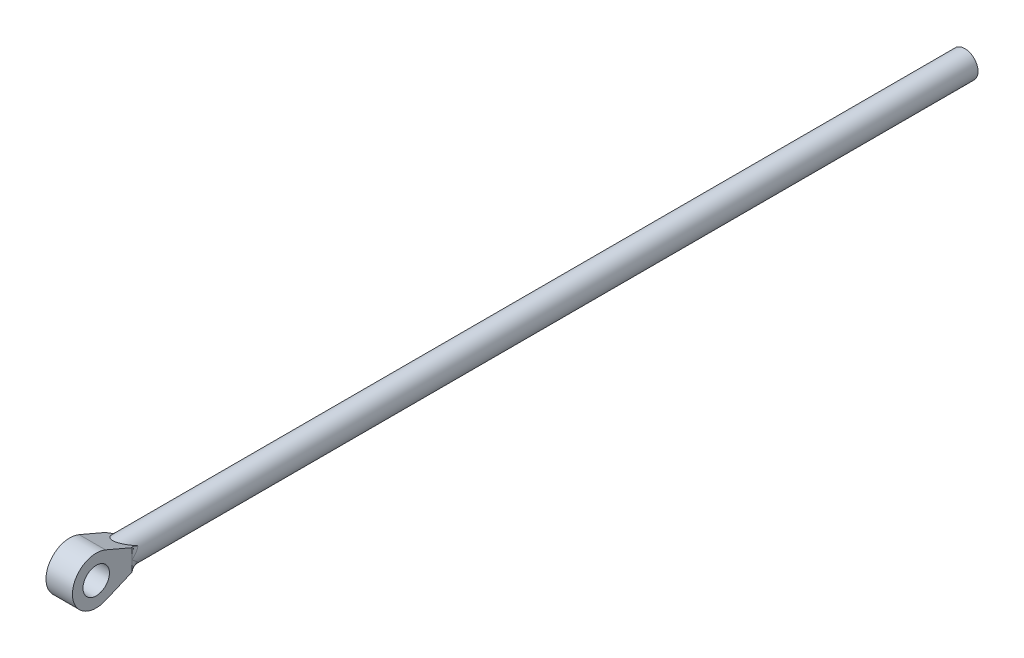
ISO-10303-21;
HEADER;
FILE_DESCRIPTION(('STEP AP214'),'2;1');
FILE_NAME('part.step','',(''),(''),'','','');
FILE_SCHEMA(('AUTOMOTIVE_DESIGN { 1 0 10303 214 1 1 1 1 }'));
ENDSEC;
DATA;
#1=APPLICATION_CONTEXT('core data for automotive mechanical design processes');
#2=APPLICATION_PROTOCOL_DEFINITION('international standard','automotive_design',2000,#1);
#3=PRODUCT_CONTEXT('',#1,'mechanical');
#4=PRODUCT('Part','Part','',(#3));
#5=PRODUCT_RELATED_PRODUCT_CATEGORY('part','',(#4));
#6=PRODUCT_DEFINITION_FORMATION('','',#4);
#7=PRODUCT_DEFINITION_CONTEXT('part definition',#1,'design');
#8=PRODUCT_DEFINITION('design','',#6,#7);
#9=PRODUCT_DEFINITION_SHAPE('','',#8);
#10=(LENGTH_UNIT() NAMED_UNIT(*) SI_UNIT(.MILLI.,.METRE.));
#11=(NAMED_UNIT(*) PLANE_ANGLE_UNIT() SI_UNIT($,.RADIAN.));
#12=(NAMED_UNIT(*) SI_UNIT($,.STERADIAN.) SOLID_ANGLE_UNIT());
#13=UNCERTAINTY_MEASURE_WITH_UNIT(LENGTH_MEASURE(1.E-05),#10,'distance_accuracy_value','');
#14=(GEOMETRIC_REPRESENTATION_CONTEXT(3) GLOBAL_UNCERTAINTY_ASSIGNED_CONTEXT((#13)) GLOBAL_UNIT_ASSIGNED_CONTEXT((#10,
#11,#12)) REPRESENTATION_CONTEXT('',''));
#15=CARTESIAN_POINT('',(0.,0.,0.));
#16=DIRECTION('',(0.,0.,1.));
#17=DIRECTION('',(1.,0.,0.));
#18=AXIS2_PLACEMENT_3D('',#15,#16,#17);
#19=CARTESIAN_POINT('',(3.175,-2.54,-8.59666640241181));
#20=DIRECTION('',(0.,0.919488252420341,0.393117480736976));
#21=DIRECTION('',(0.,-0.393117480736976,0.919488252420342));
#22=AXIS2_PLACEMENT_3D('',#19,#20,#21);
#23=PLANE('',#22);
#24=CARTESIAN_POINT('',(0.,0.,-14.5376389502871));
#25=DIRECTION('',(0.,0.919488252420341,0.393117480736976));
#26=DIRECTION('',(0.,0.393117480736976,-0.919488252420342));
#27=AXIS2_PLACEMENT_3D('',#24,#25,#26);
#28=ELLIPSE('',#27,8.07646608349199,3.175);
#29=CARTESIAN_POINT('',(2.67478021597462,-1.71060685028173,-10.5365884236224));
#30=VERTEX_POINT('',#29);
#31=CARTESIAN_POINT('',(-2.67478021597462,-1.71060685028173,-10.5365884236224));
#32=VERTEX_POINT('',#31);
#33=EDGE_CURVE('E60',#30,#32,#28,.F.);
#34=ORIENTED_EDGE('',*,*,#33,.F.);
#35=CARTESIAN_POINT('',(3.175,-3.99391372425977,-8.59666640241181));
#36=CARTESIAN_POINT('',(1.91635195902802,-2.58180728087389,-9.08135002022511));
#37=CARTESIAN_POINT('',(2.2709843247912,-2.2188409579221,-10.9669928924115));
#38=CARTESIAN_POINT('',(3.175,-3.89822005365016,-8.59666640241181));
#39=CARTESIAN_POINT('',(1.95759279660153,-2.55659693582673,-9.12196996566286));
#40=CARTESIAN_POINT('',(2.32292862845712,-2.16567780741768,-10.930950971675));
#41=CARTESIAN_POINT('',(3.175,-3.80022115930709,-8.59666640241181));
#42=CARTESIAN_POINT('',(2.00429072887889,-2.5244105662156,-9.15651333968208));
#43=CARTESIAN_POINT('',(2.37247234749937,-2.1112339772152,-10.8902967558312));
#44=CARTESIAN_POINT('',(3.175,-3.60055329402831,-8.59666640241181));
#45=CARTESIAN_POINT('',(2.10288828272783,-2.44821078011972,-9.2124927740083));
#46=CARTESIAN_POINT('',(2.46671432485945,-2.0003073854646,-10.8012878913684));
#47=CARTESIAN_POINT('',(3.175,-3.49889095821979,-8.59666640241181));
#48=CARTESIAN_POINT('',(2.15470476601244,-2.40445660023307,-9.23428275530779));
#49=CARTESIAN_POINT('',(2.51142080890993,-1.9438283100981,-10.7529466716865));
#50=CARTESIAN_POINT('',(3.175,-3.29305802574432,-8.59666640241181));
#51=CARTESIAN_POINT('',(2.25918856417076,-2.30694472080806,-9.26551549867763));
#52=CARTESIAN_POINT('',(2.59589449034021,-1.82947668099294,-10.6502315770057));
#53=CARTESIAN_POINT('',(3.175,-3.18890394684718,-8.59666640241181));
#54=CARTESIAN_POINT('',(2.31189565918958,-2.25339342902035,-9.27530338538349));
#55=CARTESIAN_POINT('',(2.63568706696168,-1.77161330379369,-10.5958917037651));
#56=CARTESIAN_POINT('',(3.175,-2.97809879860918,-8.59666640241181));
#57=CARTESIAN_POINT('',(2.415737066997,-2.13788631172421,-9.28426183538017));
#58=CARTESIAN_POINT('',(2.71073717770064,-1.65449933253319,-10.4820493293361));
#59=CARTESIAN_POINT('',(3.175,-2.87144627945739,-8.59666640241181));
#60=CARTESIAN_POINT('',(2.46698878164801,-2.07598791576069,-9.2836366142665));
#61=CARTESIAN_POINT('',(2.74599199749794,-1.59524793302146,-10.4225437735276));
#62=CARTESIAN_POINT('',(3.175,-2.45809990923821,-8.59666640241181));
#63=CARTESIAN_POINT('',(2.65372910886165,-1.82885051358634,-9.26383542983603));
#64=CARTESIAN_POINT('',(2.87287229613947,-1.36561106071748,-10.1860471642477));
#65=CARTESIAN_POINT('',(3.175,-2.14412743110158,-8.59666640241181));
#66=CARTESIAN_POINT('',(2.78145144382993,-1.61490717806444,-9.2138654185811));
#67=CARTESIAN_POINT('',(2.9489698685196,-1.19118190617343,-9.99419431779141));
#68=CARTESIAN_POINT('',(3.175,-1.50745726875889,-8.59666640241181));
#69=CARTESIAN_POINT('',(2.98354146972774,-1.159687990128,-9.07123962113244));
#70=CARTESIAN_POINT('',(3.06825926307117,-0.837476260415707,-9.59223853373834));
#71=CARTESIAN_POINT('',(3.175,-1.18474093473537,-8.59666640241181));
#72=CARTESIAN_POINT('',(3.06100044766743,-0.91555636745583,-8.97863920011173));
#73=CARTESIAN_POINT('',(3.11137388897597,-0.658189408192424,-9.38209405614999));
#74=CARTESIAN_POINT('',(3.175,-0.71952408724998,-8.59666640241181));
#75=CARTESIAN_POINT('',(3.13141138232832,-0.558155895048426,-8.83342360639511));
#76=CARTESIAN_POINT('',(3.15072965960417,-0.39973560402509,-9.0753075460424));
#77=CARTESIAN_POINT('',(3.175,-0.578219683916854,-8.59666640241181));
#78=CARTESIAN_POINT('',(3.14749268943646,-0.448982202265444,-8.78784669658839));
#79=CARTESIAN_POINT('',(3.15969106547785,-0.321233157722816,-8.98161928182636));
#80=CARTESIAN_POINT('',(3.175,-0.295456882461807,-8.59666640241181));
#81=CARTESIAN_POINT('',(3.16908360806762,-0.229956089790282,-8.69520065085295));
#82=CARTESIAN_POINT('',(3.17173138716422,-0.164142712471253,-8.79363104917733));
#83=CARTESIAN_POINT('',(3.175,-0.153999062517953,-8.59666640241181));
#84=CARTESIAN_POINT('',(3.17467408200621,-0.119781543608713,-8.64800082128869));
#85=CARTESIAN_POINT('',(3.17481939932961,-0.0855550347319821,-8.69933225397546));
#86=CARTESIAN_POINT('',(3.175,-0.00838676855715619,-8.59666640241181));
#87=CARTESIAN_POINT('',(3.17499540716319,-0.00652304627986016,-8.59946199393057));
#88=CARTESIAN_POINT('',(3.1749974348638,-0.00465931586509317,-8.60225758054907));
#89=CARTESIAN_POINT('',(3.175,-0.0041933642145215,-8.59666640241181));
#90=CARTESIAN_POINT('',(3.17500002361483,-0.00326150528047754,-8.59806419065323));
#91=CARTESIAN_POINT('',(3.17499999886311,-0.00232964678585178,-8.59946197762139));
#92=CARTESIAN_POINT('',(3.175,0.,-8.59666640241181));
#93=CARTESIAN_POINT('',(3.175,0.,-8.59666640241181));
#94=CARTESIAN_POINT('',(3.175,0.,-8.59666640241181));
#95=(BOUNDED_SURFACE() B_SPLINE_SURFACE(3,2,((#35,#36,#37),(#38,#39,#40),(#41,#42,#43),(#44,#45,
#46),(#47,#48,#49),(#50,#51,#52),(#53,#54,#55),(#56,#57,#58),(#59,#60,#61),(#62,#63,#64),(#65,
#66,#67),(#68,#69,#70),(#71,#72,#73),(#74,#75,#76),(#77,#78,#79),(#80,#81,#82),(#83,#84,#85),
(#86,#87,#88),(#89,#90,#91),(#92,#93,#94)),.UNSPECIFIED.,.F.,.F.,
.F.) B_SPLINE_SURFACE_WITH_KNOTS((4,2,2,2,2,2,2,2,2,4),(3,3),(0.,0.415332256370436,
0.829946755224234,1.24232133703608,1.654941451117,2.82617024859253,4.00013197924569,
4.51081216118512,5.02070078684461,5.03582031698667),(0.,1.),
.UNSPECIFIED.) GEOMETRIC_REPRESENTATION_ITEM() RATIONAL_B_SPLINE_SURFACE(((1.,0.792792193937669,
1.),(1.,0.802959628543372,1.),(1.,0.813010799359625,1.),(1.,0.832659898007525,1.),(1.,
0.842258579094277,1.),(1.,0.860768395540024,1.),(1.,0.869682965154839,1.),(1.,0.886767288107134,
1.),(1.,0.894936594812638,1.),(1.,0.924685397988841,1.),(1.,0.943306333627146,1.),(1.,
0.972868676598953,1.),(1.,0.983792063214889,1.),(1.,0.993800512945255,1.),(1.,0.996087213683453,
1.),(1.,0.999162677962766,1.),(1.,0.99995375781857,1.),(1.,0.999999344324297,1.),(1.,
1.00000000050463,1.),(1.,1.,1.))) REPRESENTATION_ITEM('') SURFACE());
#96=CARTESIAN_POINT('',(2.67478021597462,-1.71060685028173,-10.5365884236224));
#97=CARTESIAN_POINT('',(2.65896090264,-1.73531539556926,-10.4787959869083));
#98=CARTESIAN_POINT('',(2.64593621557644,-1.76029878647662,-10.420360695753));
#99=CARTESIAN_POINT('',(2.62553049389253,-1.81061036745387,-10.3026836400732));
#100=CARTESIAN_POINT('',(2.61814746922412,-1.83593843273112,-10.2434421674344));
#101=CARTESIAN_POINT('',(2.60910197685768,-1.88656334811981,-10.1250322333547));
#102=CARTESIAN_POINT('',(2.60739739857218,-1.91185903103886,-10.0658665019366));
#103=CARTESIAN_POINT('',(2.6095066684818,-1.96240864273729,-9.94763270059563));
#104=CARTESIAN_POINT('',(2.61332064463398,-1.9876625705349,-9.88856463296902));
#105=CARTESIAN_POINT('',(2.63281257740658,-2.06303534503004,-9.71227030850734));
#106=CARTESIAN_POINT('',(2.65652439970803,-2.1128621816823,-9.59572705311423));
#107=CARTESIAN_POINT('',(2.72339626694493,-2.2105517330952,-9.36723455580789));
#108=CARTESIAN_POINT('',(2.76661269268708,-2.25840831180812,-9.25529966589898));
#109=CARTESIAN_POINT('',(2.86511682529915,-2.34680416276593,-9.04854481397524));
#110=CARTESIAN_POINT('',(2.91888766253763,-2.38760837538996,-8.95310516553549));
#111=CARTESIAN_POINT('',(3.03839194604737,-2.466147032211,-8.76940595131474));
#112=CARTESIAN_POINT('',(3.10406499104079,-2.50389564396833,-8.68111324809796));
#113=CARTESIAN_POINT('',(3.175,-2.54,-8.59666640241181));
#114=B_SPLINE_CURVE_WITH_KNOTS('',3,(#96,#97,#98,#99,#100,#101,#102,#103,#104,#105,#106,#107,
#108,#109,#110,#111,#112,#113),.UNSPECIFIED.,.F.,.F.,(4,2,2,2,2,2,2,2,4),(0.,0.194369428069471,
0.388670262298564,0.581526941681752,0.774388092846381,1.15937812629279,1.54548822699539,
1.89529807344013,2.24338003319203),.UNSPECIFIED.);
#115=CARTESIAN_POINT('',(3.175,-2.54,-8.59666640241181));
#116=VERTEX_POINT('',#115);
#117=EDGE_CURVE('E103',#30,#116,#114,.T.);
#118=ORIENTED_EDGE('',*,*,#117,.T.);
#119=DIRECTION('',(0.,0.393117480736976,-0.919488252420341));
#120=VECTOR('',#119,1.);
#121=CARTESIAN_POINT('',(3.175,-2.54,-8.59666640241181));
#122=LINE('',#121,#120);
#123=CARTESIAN_POINT('',(3.175,-5.25487536258225,-2.24666640241182));
#124=VERTEX_POINT('',#123);
#125=EDGE_CURVE('E97',#124,#116,#122,.T.);
#126=ORIENTED_EDGE('',*,*,#125,.F.);
#127=DIRECTION('',(-1.,0.,0.));
#128=VECTOR('',#127,1.);
#129=CARTESIAN_POINT('',(3.175,-5.25487536258225,-2.24666640241182));
#130=LINE('',#129,#128);
#131=CARTESIAN_POINT('',(-3.175,-5.25487536258225,-2.24666640241182));
#132=VERTEX_POINT('',#131);
#133=EDGE_CURVE('E100',#124,#132,#130,.T.);
#134=ORIENTED_EDGE('',*,*,#133,.T.);
#135=DIRECTION('',(0.,0.393117480736976,-0.919488252420341));
#136=VECTOR('',#135,1.);
#137=CARTESIAN_POINT('',(-3.175,-2.54,-8.59666640241181));
#138=LINE('',#137,#136);
#139=CARTESIAN_POINT('',(-3.175,-2.54,-8.59666640241181));
#140=VERTEX_POINT('',#139);
#141=EDGE_CURVE('E264',#132,#140,#138,.T.);
#142=ORIENTED_EDGE('',*,*,#141,.T.);
#143=CARTESIAN_POINT('',(-2.27098432479365,-2.21884095791959,-10.9669928924098));
#144=CARTESIAN_POINT('',(-1.91635195902998,-2.58180728087268,-9.08135002022703));
#145=CARTESIAN_POINT('',(-3.175,-3.99391372425527,-8.59666640241181));
#146=CARTESIAN_POINT('',(-2.32292862845958,-2.16567780741504,-10.9309509716731));
#147=CARTESIAN_POINT('',(-1.95759279660373,-2.55659693582527,-9.12196996566466));
#148=CARTESIAN_POINT('',(-3.175,-3.89822005364541,-8.59666640241181));
#149=CARTESIAN_POINT('',(-2.37247234750184,-2.11123397721242,-10.8902967558291));
#150=CARTESIAN_POINT('',(-2.0042907288813,-2.52441056621388,-9.15651333968373));
#151=CARTESIAN_POINT('',(-3.175,-3.8002211593021,-8.59666640241181));
#152=CARTESIAN_POINT('',(-2.46671432486192,-2.00030738546156,-10.8012878913658));
#153=CARTESIAN_POINT('',(-2.10288828273059,-2.44821078011745,-9.2124927740096));
#154=CARTESIAN_POINT('',(-3.175,-3.60055329402282,-8.59666640241181));
#155=CARTESIAN_POINT('',(-2.5114208089124,-1.94382831009492,-10.7529466716838));
#156=CARTESIAN_POINT('',(-2.15470476601536,-2.40445660023053,-9.2342827553089));
#157=CARTESIAN_POINT('',(-3.175,-3.49889095821406,-8.59666640241181));
#158=CARTESIAN_POINT('',(-2.59589449034265,-1.82947668098949,-10.6502315770025));
#159=CARTESIAN_POINT('',(-2.25918856417391,-2.30694472080496,-9.26551549867833));
#160=CARTESIAN_POINT('',(-3.175,-3.29305802573812,-8.59666640241181));
#161=CARTESIAN_POINT('',(-2.63568706696408,-1.77161330379011,-10.5958917037617));
#162=CARTESIAN_POINT('',(-2.31189565919281,-2.25339342901697,-9.27530338538399));
#163=CARTESIAN_POINT('',(-3.175,-3.18890394684074,-8.59666640241181));
#164=CARTESIAN_POINT('',(-2.71073717770298,-1.65449933252936,-10.4820493293323));
#165=CARTESIAN_POINT('',(-2.41573706700034,-2.13788631172029,-9.28426183538024));
#166=CARTESIAN_POINT('',(-3.175,-2.97809879860228,-8.59666640241181));
#167=CARTESIAN_POINT('',(-2.74599199750024,-1.5952479330175,-10.4225437735236));
#168=CARTESIAN_POINT('',(-2.46698878165138,-2.07598791575649,-9.28363661426636));
#169=CARTESIAN_POINT('',(-3.175,-2.87144627945026,-8.59666640241181));
#170=CARTESIAN_POINT('',(-2.87287229614157,-1.36561106071309,-10.1860471642429));
#171=CARTESIAN_POINT('',(-2.65372910886501,-1.82885051358119,-9.26383542983508));
#172=CARTESIAN_POINT('',(-3.175,-2.45809990923031,-8.59666640241181));
#173=CARTESIAN_POINT('',(-2.94896986852151,-1.19118190616876,-9.99419431778613));
#174=CARTESIAN_POINT('',(-2.7814514438331,-1.61490717805865,-9.21386541857955));
#175=CARTESIAN_POINT('',(-3.175,-2.14412743109317,-8.59666640241181));
#176=CARTESIAN_POINT('',(-3.06825926307263,-0.837476260410397,-9.59223853373227));
#177=CARTESIAN_POINT('',(-2.98354146973029,-1.15968799012094,-9.07123962112996));
#178=CARTESIAN_POINT('',(-3.175,-1.50745726874933,-8.59666640241181));
#179=CARTESIAN_POINT('',(-3.11137388897716,-0.658189408186761,-9.38209405614367));
#180=CARTESIAN_POINT('',(-3.06100044766955,-0.915556367448113,-8.97863920010891));
#181=CARTESIAN_POINT('',(-3.175,-1.18474093472518,-8.59666640241181));
#182=CARTESIAN_POINT('',(-3.15072965960476,-0.399735604020243,-9.07530754603647));
#183=CARTESIAN_POINT('',(-3.13141138232938,-0.558155895041695,-8.83342360639224));
#184=CARTESIAN_POINT('',(-3.175,-0.719524087241256,-8.59666640241181));
#185=CARTESIAN_POINT('',(-3.15969106547823,-0.32123315771901,-8.9816192818214));
#186=CARTESIAN_POINT('',(-3.14749268943713,-0.448982202260144,-8.78784669658596));
#187=CARTESIAN_POINT('',(-3.175,-0.578219683910004,-8.59666640241181));
#188=CARTESIAN_POINT('',(-3.17173138716429,-0.164142712469191,-8.79363104917527));
#189=CARTESIAN_POINT('',(-3.16908360806776,-0.229956089787388,-8.69520065085192));
#190=CARTESIAN_POINT('',(-3.175,-0.295456882458093,-8.59666640241181));
#191=CARTESIAN_POINT('',(-3.17481939932961,-0.0855550347306216,-8.69933225397532));
#192=CARTESIAN_POINT('',(-3.17467408200621,-0.119781543606808,-8.64800082128861));
#193=CARTESIAN_POINT('',(-3.175,-0.153999062515503,-8.59666640241181));
#194=CARTESIAN_POINT('',(-3.1749974348638,-0.00465931586507049,-8.60225758054913));
#195=CARTESIAN_POINT('',(-3.17499540716319,-0.00652304627982837,-8.59946199393061));
#196=CARTESIAN_POINT('',(-3.175,-0.00838676855711528,-8.59666640241181));
#197=CARTESIAN_POINT('',(-3.17499999886311,-0.00232964678584015,-8.59946197762142));
#198=CARTESIAN_POINT('',(-3.17500002361483,-0.00326150528046124,-8.59806419065324));
#199=CARTESIAN_POINT('',(-3.175,-0.00419336421450054,-8.59666640241181));
#200=CARTESIAN_POINT('',(-3.175,0.,-8.59666640241181));
#201=CARTESIAN_POINT('',(-3.175,0.,-8.59666640241181));
#202=CARTESIAN_POINT('',(-3.175,0.,-8.59666640241181));
#203=(BOUNDED_SURFACE() B_SPLINE_SURFACE(3,2,((#143,#144,#145),(#146,#147,#148),(#149,#150,
#151),(#152,#153,#154),(#155,#156,#157),(#158,#159,#160),(#161,#162,#163),(#164,#165,#166),
(#167,#168,#169),(#170,#171,#172),(#173,#174,#175),(#176,#177,#178),(#179,#180,#181),(#182,#183,
#184),(#185,#186,#187),(#188,#189,#190),(#191,#192,#193),(#194,#195,#196),(#197,#198,#199),
(#200,#201,#202)),.UNSPECIFIED.,.F.,.F.,.F.) B_SPLINE_SURFACE_WITH_KNOTS((4,2,2,2,2,2,2,2,2,4),
(3,3),(0.,0.415332256371179,0.82994675522572,1.24232133703825,1.65494145111987,2.82617024859706,
4.00013197925189,4.51081216118494,5.02070078683809,5.03582031698015),(0.,1.),
.UNSPECIFIED.) GEOMETRIC_REPRESENTATION_ITEM() RATIONAL_B_SPLINE_SURFACE(((1.,0.792792193938146,
1.),(1.,0.802959628543865,1.),(1.,0.813010799360131,1.),(1.,0.832659898008051,1.),(1.,
0.842258579094809,1.),(1.,0.860768395540565,1.),(1.,0.869682965155381,1.),(1.,0.886767288107673,
1.),(1.,0.894936594813173,1.),(1.,0.924685397989347,1.),(1.,0.943306333627614,1.),(1.,
0.972868676599319,1.),(1.,0.983792063215191,1.),(1.,0.993800512945407,1.),(1.,0.996087213683549,
1.),(1.,0.999162677962785,1.),(1.,0.999953757818569,1.),(1.,0.999999344324297,1.),(1.,
1.00000000050463,1.),(1.,1.,1.))) REPRESENTATION_ITEM('') SURFACE());
#204=CARTESIAN_POINT('',(-3.175,-2.54,-8.59666640241181));
#205=CARTESIAN_POINT('',(-3.12274790795525,-2.51339513186286,-8.65889427297974));
#206=CARTESIAN_POINT('',(-3.07338709167486,-2.48593299171681,-8.72312727326067));
#207=CARTESIAN_POINT('',(-2.98094895119323,-2.42936341368688,-8.85544156858376));
#208=CARTESIAN_POINT('',(-2.93788130463324,-2.40025353531847,-8.92352857183519));
#209=CARTESIAN_POINT('',(-2.81881369723286,-2.31046730182375,-9.13353548064192));
#210=CARTESIAN_POINT('',(-2.75333444689144,-2.24752780330389,-9.28074880067477));
#211=CARTESIAN_POINT('',(-2.66826345745968,-2.13346753368451,-9.54753184422273));
#212=CARTESIAN_POINT('',(-2.64139521950859,-2.08318111873803,-9.66515003742274));
#213=CARTESIAN_POINT('',(-2.617475663847,-2.00708677037642,-9.84313209831434));
#214=CARTESIAN_POINT('',(-2.61222784708377,-1.98165670452371,-9.90261214678741));
#215=CARTESIAN_POINT('',(-2.60731207132854,-1.93071606147583,-10.0217605569915));
#216=CARTESIAN_POINT('',(-2.60764249931384,-1.90520550968744,-10.081428859297));
#217=CARTESIAN_POINT('',(-2.614369663958,-1.85126915700596,-10.207584131192));
#218=CARTESIAN_POINT('',(-2.62148185356562,-1.82285677160672,-10.2740397224032));
#219=CARTESIAN_POINT('',(-2.6428027895673,-1.76638189740917,-10.406132508723));
#220=CARTESIAN_POINT('',(-2.6570273705171,-1.7383203331824,-10.4717675412905));
#221=CARTESIAN_POINT('',(-2.67478021597498,-1.71060685028117,-10.5365884236221));
#222=B_SPLINE_CURVE_WITH_KNOTS('',3,(#204,#205,#206,#207,#208,#209,#210,#211,#212,#213,#214,
#215,#216,#217,#218,#219,#220,#221),.UNSPECIFIED.,.F.,.F.,(4,2,2,2,2,2,2,2,4),(0.,
0.256328898497091,0.513047922516331,1.02833474887131,1.41868761538263,1.61317812630623,
1.80761239870895,2.0251272446223,2.24312852188396),.UNSPECIFIED.);
#223=EDGE_CURVE('E45',#140,#32,#222,.T.);
#224=ORIENTED_EDGE('',*,*,#223,.T.);
#225=EDGE_LOOP('',(#34,#118,#126,#134,#142,#224));
#226=FACE_BOUND('',#225,.T.);
#227=ADVANCED_FACE('F33',(#226),#23,.F.);
#228=CARTESIAN_POINT('',(3.175,5.25487536258225,-2.24666640241182));
#229=DIRECTION('',(0.,-0.919488252420341,0.393117480736976));
#230=DIRECTION('',(0.,-0.393117480736976,-0.919488252420342));
#231=AXIS2_PLACEMENT_3D('',#228,#229,#230);
#232=PLANE('',#231);
#233=CARTESIAN_POINT('',(0.,0.,-14.5376389502871));
#234=DIRECTION('',(0.,-0.919488252420341,0.393117480736976));
#235=DIRECTION('',(0.,-0.393117480736976,-0.919488252420342));
#236=AXIS2_PLACEMENT_3D('',#233,#234,#235);
#237=ELLIPSE('',#236,8.07646608349199,3.175);
#238=CARTESIAN_POINT('',(-2.67478021597462,1.71060685028173,-10.5365884236224));
#239=VERTEX_POINT('',#238);
#240=CARTESIAN_POINT('',(2.67478021597462,1.71060685028173,-10.5365884236224));
#241=VERTEX_POINT('',#240);
#242=EDGE_CURVE('E52',#239,#241,#237,.F.);
#243=ORIENTED_EDGE('',*,*,#242,.F.);
#244=CARTESIAN_POINT('',(-3.175,3.99391372425977,-8.59666640241181));
#245=CARTESIAN_POINT('',(-1.91635195902802,2.58180728087388,-9.08135002022511));
#246=CARTESIAN_POINT('',(-2.27098432479121,2.21884095792209,-10.9669928924115));
#247=CARTESIAN_POINT('',(-3.175,3.89822005365014,-8.59666640241181));
#248=CARTESIAN_POINT('',(-1.95759279660154,2.55659693582672,-9.12196996566286));
#249=CARTESIAN_POINT('',(-2.32292862845713,2.16567780741767,-10.930950971675));
#250=CARTESIAN_POINT('',(-3.175,3.80022115930706,-8.59666640241181));
#251=CARTESIAN_POINT('',(-2.00429072887891,2.52441056621559,-9.15651333968209));
#252=CARTESIAN_POINT('',(-2.37247234749938,2.11123397721518,-10.8902967558312));
#253=CARTESIAN_POINT('',(-3.175,3.60055329402824,-8.59666640241181));
#254=CARTESIAN_POINT('',(-2.10288828272786,2.44821078011969,-9.21249277400832));
#255=CARTESIAN_POINT('',(-2.46671432485948,2.00030738546457,-10.8012878913684));
#256=CARTESIAN_POINT('',(-3.175,3.49889095821971,-8.59666640241181));
#257=CARTESIAN_POINT('',(-2.15470476601248,2.40445660023304,-9.23428275530781));
#258=CARTESIAN_POINT('',(-2.51142080890997,1.94382831009806,-10.7529466716865));
#259=CARTESIAN_POINT('',(-3.175,3.29305802574424,-8.59666640241181));
#260=CARTESIAN_POINT('',(-2.2591885641708,2.30694472080802,-9.26551549867764));
#261=CARTESIAN_POINT('',(-2.59589449034024,1.8294766809929,-10.6502315770056));
#262=CARTESIAN_POINT('',(-3.175,3.18890394684711,-8.59666640241181));
#263=CARTESIAN_POINT('',(-2.31189565918962,2.25339342902031,-9.2753033853835));
#264=CARTESIAN_POINT('',(-2.6356870669617,1.77161330379365,-10.595891703765));
#265=CARTESIAN_POINT('',(-3.175,2.97809879860914,-8.59666640241181));
#266=CARTESIAN_POINT('',(-2.41573706699702,2.13788631172419,-9.28426183538017));
#267=CARTESIAN_POINT('',(-2.71073717770065,1.65449933253317,-10.482049329336));
#268=CARTESIAN_POINT('',(-3.175,2.87144627945736,-8.59666640241181));
#269=CARTESIAN_POINT('',(-2.46698878164802,2.07598791576067,-9.2836366142665));
#270=CARTESIAN_POINT('',(-2.74599199749794,1.59524793302144,-10.4225437735276));
#271=CARTESIAN_POINT('',(-3.175,2.45809990923822,-8.59666640241181));
#272=CARTESIAN_POINT('',(-2.65372910886164,1.82885051358635,-9.26383542983602));
#273=CARTESIAN_POINT('',(-2.87287229613947,1.36561106071749,-10.1860471642477));
#274=CARTESIAN_POINT('',(-3.175,2.14412743110167,-8.59666640241181));
#275=CARTESIAN_POINT('',(-2.78145144382993,1.61490717806451,-9.21386541858104));
#276=CARTESIAN_POINT('',(-2.9489698685196,1.19118190617348,-9.99419431779131));
#277=CARTESIAN_POINT('',(-3.175,1.50745726875883,-8.59666640241181));
#278=CARTESIAN_POINT('',(-2.98354146972773,1.15968799012795,-9.0712396211325));
#279=CARTESIAN_POINT('',(-3.06825926307117,0.837476260415675,-9.59223853373845));
#280=CARTESIAN_POINT('',(-3.175,1.18474093473509,-8.59666640241181));
#281=CARTESIAN_POINT('',(-3.06100044766743,0.915556367455609,-8.97863920011195));
#282=CARTESIAN_POINT('',(-3.11137388897597,0.658189408192269,-9.38209405615041));
#283=CARTESIAN_POINT('',(-3.175,0.719524087250087,-8.59666640241181));
#284=CARTESIAN_POINT('',(-3.13141138232832,0.55815589504851,-8.83342360639501));
#285=CARTESIAN_POINT('',(-3.15072965960417,0.399735604025149,-9.07530754604221));
#286=CARTESIAN_POINT('',(-3.175,0.578219683917175,-8.59666640241181));
#287=CARTESIAN_POINT('',(-3.14749268943646,0.448982202265695,-8.78784669658813));
#288=CARTESIAN_POINT('',(-3.15969106547785,0.321233157722994,-8.98161928182585));
#289=CARTESIAN_POINT('',(-3.175,0.295456882461466,-8.59666640241181));
#290=CARTESIAN_POINT('',(-3.16908360806762,0.229956089790016,-8.6952006508532));
#291=CARTESIAN_POINT('',(-3.17173138716422,0.164142712471064,-8.79363104917782));
#292=CARTESIAN_POINT('',(-3.175,0.153999062516737,-8.59666640241181));
#293=CARTESIAN_POINT('',(-3.17467408200621,0.119781543607768,-8.6480008212896));
#294=CARTESIAN_POINT('',(-3.17481939932961,0.0855550347313069,-8.69933225397727));
#295=CARTESIAN_POINT('',(-3.175,0.0083867685570856,-8.59666640241181));
#296=CARTESIAN_POINT('',(-3.17499540716319,0.00652304627980527,-8.59946199393063));
#297=CARTESIAN_POINT('',(-3.1749974348638,0.00465931586505396,-8.60225758054918));
#298=CARTESIAN_POINT('',(-3.175,0.0041933642144853,-8.59666640241181));
#299=CARTESIAN_POINT('',(-3.17500002361483,0.00326150528044939,-8.59806419065325));
#300=CARTESIAN_POINT('',(-3.17499999886311,0.00232964678583167,-8.59946197762145));
#301=CARTESIAN_POINT('',(-3.175,0.,-8.59666640241181));
#302=CARTESIAN_POINT('',(-3.175,0.,-8.59666640241181));
#303=CARTESIAN_POINT('',(-3.175,0.,-8.59666640241181));
#304=(BOUNDED_SURFACE() B_SPLINE_SURFACE(3,2,((#244,#245,#246),(#247,#248,#249),(#250,#251,
#252),(#253,#254,#255),(#256,#257,#258),(#259,#260,#261),(#262,#263,#264),(#265,#266,#267),
(#268,#269,#270),(#271,#272,#273),(#274,#275,#276),(#277,#278,#279),(#280,#281,#282),(#283,#284,
#285),(#286,#287,#288),(#289,#290,#291),(#292,#293,#294),(#295,#296,#297),(#298,#299,#300),
(#301,#302,#303)),.UNSPECIFIED.,.F.,.F.,.F.) B_SPLINE_SURFACE_WITH_KNOTS((4,2,2,2,2,2,2,2,2,4),
(3,3),(0.,0.415332256370493,0.829946755224349,1.24232133703614,1.65494145111701,
2.82617024859249,4.0001319792457,4.51081216118512,5.0207007868446,5.03582031698666),(0.,1.),
.UNSPECIFIED.) GEOMETRIC_REPRESENTATION_ITEM() RATIONAL_B_SPLINE_SURFACE(((1.,0.792792193937669,
1.),(1.,0.802959628543374,1.),(1.,0.813010799359628,1.),(1.,0.832659898007531,1.),(1.,
0.842258579094283,1.),(1.,0.860768395540031,1.),(1.,0.869682965154845,1.),(1.,0.886767288107137,
1.),(1.,0.89493659481264,1.),(1.,0.92468539798884,1.),(1.,0.943306333627145,1.),(1.,
0.972868676598952,1.),(1.,0.983792063214889,1.),(1.,0.993800512945255,1.),(1.,0.996087213683454,
1.),(1.,0.999162677962766,1.),(1.,0.999953757818569,1.),(1.,0.999999344324297,1.),(1.,
1.00000000050463,1.),(1.,1.,1.))) REPRESENTATION_ITEM('') SURFACE());
#305=CARTESIAN_POINT('',(-2.67478021597462,1.71060685028173,-10.5365884236224));
#306=CARTESIAN_POINT('',(-2.65896090263902,1.73531539556922,-10.4787959869084));
#307=CARTESIAN_POINT('',(-2.64593621557562,1.76029878647659,-10.4203606957531));
#308=CARTESIAN_POINT('',(-2.62553049389237,1.81061036745386,-10.3026836400732));
#309=CARTESIAN_POINT('',(-2.61814746922445,1.83593843273113,-10.2434421674343));
#310=CARTESIAN_POINT('',(-2.60910197685734,1.88656334811987,-10.1250322333545));
#311=CARTESIAN_POINT('',(-2.6073973985707,1.91185903103896,-10.0658665019364));
#312=CARTESIAN_POINT('',(-2.60950666848023,1.96240864273737,-9.94763270059544));
#313=CARTESIAN_POINT('',(-2.61332064463344,1.98766257053494,-9.88856463296893));
#314=CARTESIAN_POINT('',(-2.6328125774076,2.06303534502972,-9.71227030850808));
#315=CARTESIAN_POINT('',(-2.65652439970804,2.1128621816817,-9.59572705311563));
#316=CARTESIAN_POINT('',(-2.72339626694412,2.21055173309463,-9.36723455580921));
#317=CARTESIAN_POINT('',(-2.76661269268669,2.25840831180784,-9.25529966589963));
#318=CARTESIAN_POINT('',(-2.865116825298,2.34680416276482,-9.04854481397783));
#319=CARTESIAN_POINT('',(-2.91888766253483,2.38760837538781,-8.95310516554052));
#320=CARTESIAN_POINT('',(-3.03839194604386,2.466147032209,-8.76940595131943));
#321=CARTESIAN_POINT('',(-3.10406499103883,2.50389564396737,-8.68111324810021));
#322=CARTESIAN_POINT('',(-3.175,2.54,-8.59666640241181));
#323=B_SPLINE_CURVE_WITH_KNOTS('',3,(#305,#306,#307,#308,#309,#310,#311,#312,#313,#314,#315,
#316,#317,#318,#319,#320,#321,#322),.UNSPECIFIED.,.F.,.F.,(4,2,2,2,2,2,2,2,4),(0.,
0.194369428069507,0.388670262298641,0.581526941682158,0.774388092846556,1.15937812629067,
1.54548822699557,1.8952980734311,2.2433800331922),.UNSPECIFIED.);
#324=CARTESIAN_POINT('',(-3.175,2.54,-8.59666640241181));
#325=VERTEX_POINT('',#324);
#326=EDGE_CURVE('E188',#239,#325,#323,.T.);
#327=ORIENTED_EDGE('',*,*,#326,.T.);
#328=DIRECTION('',(0.,0.393117480736976,0.919488252420341));
#329=VECTOR('',#328,1.);
#330=CARTESIAN_POINT('',(-3.175,5.25487536258225,-2.24666640241182));
#331=LINE('',#330,#329);
#332=CARTESIAN_POINT('',(-3.175,5.25487536258225,-2.24666640241182));
#333=VERTEX_POINT('',#332);
#334=EDGE_CURVE('E118',#325,#333,#331,.T.);
#335=ORIENTED_EDGE('',*,*,#334,.T.);
#336=DIRECTION('',(-1.,0.,0.));
#337=VECTOR('',#336,1.);
#338=CARTESIAN_POINT('',(3.175,5.25487536258225,-2.24666640241182));
#339=LINE('',#338,#337);
#340=CARTESIAN_POINT('',(3.175,5.25487536258225,-2.24666640241182));
#341=VERTEX_POINT('',#340);
#342=EDGE_CURVE('E124',#341,#333,#339,.T.);
#343=ORIENTED_EDGE('',*,*,#342,.F.);
#344=DIRECTION('',(0.,0.393117480736976,0.919488252420341));
#345=VECTOR('',#344,1.);
#346=CARTESIAN_POINT('',(3.175,5.25487536258225,-2.24666640241182));
#347=LINE('',#346,#345);
#348=CARTESIAN_POINT('',(3.175,2.54,-8.59666640241181));
#349=VERTEX_POINT('',#348);
#350=EDGE_CURVE('E114',#349,#341,#347,.T.);
#351=ORIENTED_EDGE('',*,*,#350,.F.);
#352=CARTESIAN_POINT('',(2.27098432479365,2.2188409579196,-10.9669928924098));
#353=CARTESIAN_POINT('',(1.91635195902998,2.58180728087268,-9.08135002022703));
#354=CARTESIAN_POINT('',(3.175,3.99391372425527,-8.59666640241181));
#355=CARTESIAN_POINT('',(2.32292862845958,2.16567780741504,-10.9309509716731));
#356=CARTESIAN_POINT('',(1.95759279660372,2.55659693582527,-9.12196996566466));
#357=CARTESIAN_POINT('',(3.175,3.89822005364541,-8.59666640241181));
#358=CARTESIAN_POINT('',(2.37247234750183,2.11123397721243,-10.8902967558291));
#359=CARTESIAN_POINT('',(2.0042907288813,2.52441056621388,-9.15651333968372));
#360=CARTESIAN_POINT('',(3.175,3.8002211593021,-8.59666640241181));
#361=CARTESIAN_POINT('',(2.46671432486192,2.00030738546157,-10.8012878913658));
#362=CARTESIAN_POINT('',(2.10288828273059,2.44821078011746,-9.2124927740096));
#363=CARTESIAN_POINT('',(3.175,3.60055329402284,-8.59666640241181));
#364=CARTESIAN_POINT('',(2.51142080891239,1.94382831009493,-10.7529466716838));
#365=CARTESIAN_POINT('',(2.15470476601534,2.40445660023054,-9.2342827553089));
#366=CARTESIAN_POINT('',(3.175,3.49889095821408,-8.59666640241181));
#367=CARTESIAN_POINT('',(2.59589449034264,1.8294766809895,-10.6502315770025));
#368=CARTESIAN_POINT('',(2.25918856417389,2.30694472080497,-9.26551549867833));
#369=CARTESIAN_POINT('',(3.175,3.29305802573814,-8.59666640241181));
#370=CARTESIAN_POINT('',(2.63568706696408,1.77161330379012,-10.5958917037617));
#371=CARTESIAN_POINT('',(2.3118956591928,2.25339342901698,-9.27530338538399));
#372=CARTESIAN_POINT('',(3.175,3.18890394684076,-8.59666640241181));
#373=CARTESIAN_POINT('',(2.71073717770297,1.65449933252937,-10.4820493293323));
#374=CARTESIAN_POINT('',(2.41573706700034,2.1378863117203,-9.28426183538024));
#375=CARTESIAN_POINT('',(3.175,2.97809879860229,-8.59666640241181));
#376=CARTESIAN_POINT('',(2.74599199750023,1.5952479330175,-10.4225437735236));
#377=CARTESIAN_POINT('',(2.46698878165138,2.0759879157565,-9.28363661426636));
#378=CARTESIAN_POINT('',(3.175,2.87144627945027,-8.59666640241181));
#379=CARTESIAN_POINT('',(2.87287229614158,1.36561106071309,-10.186047164243));
#380=CARTESIAN_POINT('',(2.65372910886501,1.82885051358119,-9.26383542983509));
#381=CARTESIAN_POINT('',(3.175,2.4580999092303,-8.59666640241181));
#382=CARTESIAN_POINT('',(2.94896986852152,1.19118190616874,-9.99419431778617));
#383=CARTESIAN_POINT('',(2.7814514438331,1.61490717805862,-9.21386541857957));
#384=CARTESIAN_POINT('',(3.175,2.14412743109314,-8.59666640241181));
#385=CARTESIAN_POINT('',(3.06825926307263,0.837476260410408,-9.59223853373222));
#386=CARTESIAN_POINT('',(2.98354146973029,1.15968799012095,-9.07123962112994));
#387=CARTESIAN_POINT('',(3.175,1.50745726874935,-8.59666640241181));
#388=CARTESIAN_POINT('',(3.11137388897716,0.658189408186815,-9.38209405614352));
#389=CARTESIAN_POINT('',(3.06100044766955,0.91555636744819,-8.97863920010883));
#390=CARTESIAN_POINT('',(3.175,1.18474093472527,-8.59666640241181));
#391=CARTESIAN_POINT('',(3.15072965960476,0.39973560402022,-9.07530754603654));
#392=CARTESIAN_POINT('',(3.13141138232938,0.558155895041663,-8.83342360639227));
#393=CARTESIAN_POINT('',(3.175,0.719524087241215,-8.59666640241181));
#394=CARTESIAN_POINT('',(3.15969106547823,0.321233157718945,-8.98161928182158));
#395=CARTESIAN_POINT('',(3.14749268943713,0.448982202260053,-8.78784669658604));
#396=CARTESIAN_POINT('',(3.175,0.578219683909888,-8.59666640241181));
#397=CARTESIAN_POINT('',(3.17173138716429,0.164142712469257,-8.79363104917508));
#398=CARTESIAN_POINT('',(3.16908360806776,0.22995608978748,-8.69520065085183));
#399=CARTESIAN_POINT('',(3.175,0.295456882458213,-8.59666640241181));
#400=CARTESIAN_POINT('',(3.1748193993296,0.0855550347308609,-8.69933225397466));
#401=CARTESIAN_POINT('',(3.17467408200622,0.119781543607143,-8.6480008212883));
#402=CARTESIAN_POINT('',(3.175,0.153999062515934,-8.59666640241181));
#403=CARTESIAN_POINT('',(3.1749974348638,0.00465931586508478,-8.60225758054909));
#404=CARTESIAN_POINT('',(3.17499540716319,0.00652304627984841,-8.59946199393059));
#405=CARTESIAN_POINT('',(3.175,0.00838676855714107,-8.59666640241181));
#406=CARTESIAN_POINT('',(3.17499999886311,0.00232964678584748,-8.5994619776214));
#407=CARTESIAN_POINT('',(3.17500002361483,0.00326150528047151,-8.59806419065323));
#408=CARTESIAN_POINT('',(3.175,0.00419336421451375,-8.59666640241181));
#409=CARTESIAN_POINT('',(3.175,0.,-8.59666640241181));
#410=CARTESIAN_POINT('',(3.175,0.,-8.59666640241181));
#411=CARTESIAN_POINT('',(3.175,0.,-8.59666640241181));
#412=(BOUNDED_SURFACE() B_SPLINE_SURFACE(3,2,((#352,#353,#354),(#355,#356,#357),(#358,#359,
#360),(#361,#362,#363),(#364,#365,#366),(#367,#368,#369),(#370,#371,#372),(#373,#374,#375),
(#376,#377,#378),(#379,#380,#381),(#382,#383,#384),(#385,#386,#387),(#388,#389,#390),(#391,#392,
#393),(#394,#395,#396),(#397,#398,#399),(#400,#401,#402),(#403,#404,#405),(#406,#407,#408),
(#409,#410,#411)),.UNSPECIFIED.,.F.,.F.,.F.) B_SPLINE_SURFACE_WITH_KNOTS((4,2,2,2,2,2,2,2,2,4),
(3,3),(0.,0.415332256371163,0.829946755225685,1.24232133703823,1.65494145111987,
2.82617024859707,4.00013197925189,4.51081216118495,5.02070078683809,5.03582031698015),(0.,1.),
.UNSPECIFIED.) GEOMETRIC_REPRESENTATION_ITEM() RATIONAL_B_SPLINE_SURFACE(((1.,0.792792193938146,
1.),(1.,0.802959628543865,1.),(1.,0.81301079936013,1.),(1.,0.83265989800805,1.),(1.,
0.842258579094807,1.),(1.,0.860768395540563,1.),(1.,0.869682965155379,1.),(1.,0.886767288107672,
1.),(1.,0.894936594813172,1.),(1.,0.924685397989347,1.),(1.,0.943306333627615,1.),(1.,
0.972868676599319,1.),(1.,0.983792063215191,1.),(1.,0.993800512945407,1.),(1.,0.996087213683549,
1.),(1.,0.999162677962785,1.),(1.,0.999953757818569,1.),(1.,0.999999344324297,1.),(1.,
1.00000000050463,1.),(1.,1.,1.))) REPRESENTATION_ITEM('') SURFACE());
#413=CARTESIAN_POINT('',(3.175,2.54,-8.59666640241181));
#414=CARTESIAN_POINT('',(3.12274790795372,2.51339513186197,-8.65889427298182));
#415=CARTESIAN_POINT('',(3.07338709167186,2.485932991715,-8.7231272732649));
#416=CARTESIAN_POINT('',(2.98094895118771,2.42936341368321,-8.85544156859232));
#417=CARTESIAN_POINT('',(2.93788130462665,2.40025353531387,-8.92352857184596));
#418=CARTESIAN_POINT('',(2.81881369722867,2.31046730181986,-9.13353548065102));
#419=CARTESIAN_POINT('',(2.75333444688975,2.24752780330189,-9.28074880067945));
#420=CARTESIAN_POINT('',(2.66826345745922,2.1334675336837,-9.54753184422464));
#421=CARTESIAN_POINT('',(2.64139521950814,2.08318111873636,-9.66515003742667));
#422=CARTESIAN_POINT('',(2.6174756638463,2.00708677037433,-9.84313209831924));
#423=CARTESIAN_POINT('',(2.6122278470829,1.98165670452206,-9.90261214679127));
#424=CARTESIAN_POINT('',(2.60731207132795,1.93071606147502,-10.0217605569934));
#425=CARTESIAN_POINT('',(2.60764249931371,1.90520550968704,-10.081428859298));
#426=CARTESIAN_POINT('',(2.6143696639582,1.85126915700595,-10.207584131192));
#427=CARTESIAN_POINT('',(2.62148185356573,1.8228567716067,-10.2740397224032));
#428=CARTESIAN_POINT('',(2.64280278956721,1.76638189740915,-10.406132508723));
#429=CARTESIAN_POINT('',(2.65702737051691,1.73832033318239,-10.4717675412906));
#430=CARTESIAN_POINT('',(2.67478021597498,1.71060685028117,-10.5365884236221));
#431=B_SPLINE_CURVE_WITH_KNOTS('',3,(#413,#414,#415,#416,#417,#418,#419,#420,#421,#422,#423,
#424,#425,#426,#427,#428,#429,#430),.UNSPECIFIED.,.F.,.F.,(4,2,2,2,2,2,2,2,4),(0.,
0.2563288985053,0.513047922532326,1.02833474887135,1.41868761538912,1.61317812630939,
1.80761239870903,2.02512724462247,2.24312852188404),.UNSPECIFIED.);
#432=EDGE_CURVE('E11',#349,#241,#431,.T.);
#433=ORIENTED_EDGE('',*,*,#432,.T.);
#434=EDGE_LOOP('',(#243,#327,#335,#343,#351,#433));
#435=FACE_BOUND('',#434,.T.);
#436=ADVANCED_FACE('F179',(#435),#232,.F.);
#437=CARTESIAN_POINT('',(3.175,0.,0.));
#438=DIRECTION('',(1.,0.,0.));
#439=DIRECTION('',(0.,0.,-1.));
#440=AXIS2_PLACEMENT_3D('',#437,#438,#439);
#441=PLANE('',#440);
#442=CARTESIAN_POINT('',(3.175,0.,0.));
#443=DIRECTION('',(1.,0.,0.));
#444=DIRECTION('',(0.,0.,-1.));
#445=AXIS2_PLACEMENT_3D('',#442,#443,#444);
#446=CIRCLE('',#445,5.715);
#447=EDGE_CURVE('E108',#341,#124,#446,.T.);
#448=ORIENTED_EDGE('',*,*,#447,.T.);
#449=ORIENTED_EDGE('',*,*,#125,.T.);
#450=DIRECTION('',(0.,1.,0.));
#451=VECTOR('',#450,1.);
#452=CARTESIAN_POINT('',(3.175,2.54,-8.59666640241181));
#453=LINE('',#452,#451);
#454=CARTESIAN_POINT('',(3.175,0.,-8.5966664024118));
#455=VERTEX_POINT('',#454);
#456=EDGE_CURVE('E262',#116,#455,#453,.T.);
#457=ORIENTED_EDGE('',*,*,#456,.T.);
#458=EDGE_CURVE('E107',#455,#349,#453,.T.);
#459=ORIENTED_EDGE('',*,*,#458,.T.);
#460=ORIENTED_EDGE('',*,*,#350,.T.);
#461=EDGE_LOOP('',(#448,#449,#457,#459,#460));
#462=FACE_BOUND('',#461,.T.);
#463=CARTESIAN_POINT('',(3.175,0.,0.));
#464=DIRECTION('',(1.,0.,0.));
#465=DIRECTION('',(0.,0.,-1.));
#466=AXIS2_PLACEMENT_3D('',#463,#464,#465);
#467=CIRCLE('',#466,3.175);
#468=CARTESIAN_POINT('',(3.175,0.,-3.175));
#469=VERTEX_POINT('',#468);
#470=EDGE_CURVE('E274',#469,#469,#467,.T.);
#471=ORIENTED_EDGE('',*,*,#470,.F.);
#472=EDGE_LOOP('',(#471));
#473=FACE_BOUND('',#472,.T.);
#474=ADVANCED_FACE('F111',(#462,#473),#441,.T.);
#475=CARTESIAN_POINT('',(-3.175,0.,0.));
#476=DIRECTION('',(1.,0.,0.));
#477=DIRECTION('',(0.,0.,-1.));
#478=AXIS2_PLACEMENT_3D('',#475,#476,#477);
#479=PLANE('',#478);
#480=CARTESIAN_POINT('',(-3.175,0.,0.));
#481=DIRECTION('',(1.,0.,0.));
#482=DIRECTION('',(0.,0.,-1.));
#483=AXIS2_PLACEMENT_3D('',#480,#481,#482);
#484=CIRCLE('',#483,5.715);
#485=EDGE_CURVE('E122',#333,#132,#484,.T.);
#486=ORIENTED_EDGE('',*,*,#485,.F.);
#487=ORIENTED_EDGE('',*,*,#334,.F.);
#488=DIRECTION('',(0.,1.,0.));
#489=VECTOR('',#488,1.);
#490=CARTESIAN_POINT('',(-3.175,2.54,-8.59666640241181));
#491=LINE('',#490,#489);
#492=CARTESIAN_POINT('',(-3.175,0.,-8.5966664024118));
#493=VERTEX_POINT('',#492);
#494=EDGE_CURVE('E268',#493,#325,#491,.T.);
#495=ORIENTED_EDGE('',*,*,#494,.F.);
#496=EDGE_CURVE('E266',#140,#493,#491,.T.);
#497=ORIENTED_EDGE('',*,*,#496,.F.);
#498=ORIENTED_EDGE('',*,*,#141,.F.);
#499=EDGE_LOOP('',(#486,#487,#495,#497,#498));
#500=FACE_BOUND('',#499,.T.);
#501=CARTESIAN_POINT('',(-3.175,0.,0.));
#502=DIRECTION('',(1.,0.,0.));
#503=DIRECTION('',(0.,0.,-1.));
#504=AXIS2_PLACEMENT_3D('',#501,#502,#503);
#505=CIRCLE('',#504,3.175);
#506=CARTESIAN_POINT('',(-3.175,0.,-3.175));
#507=VERTEX_POINT('',#506);
#508=EDGE_CURVE('E277',#507,#507,#505,.T.);
#509=ORIENTED_EDGE('',*,*,#508,.T.);
#510=EDGE_LOOP('',(#509));
#511=FACE_BOUND('',#510,.T.);
#512=ADVANCED_FACE('F183',(#500,#511),#479,.F.);
#513=CARTESIAN_POINT('',(3.175,0.,0.));
#514=DIRECTION('',(-1.,0.,0.));
#515=DIRECTION('',(0.,0.,1.));
#516=AXIS2_PLACEMENT_3D('',#513,#514,#515);
#517=CYLINDRICAL_SURFACE('',#516,5.715);
#518=ORIENTED_EDGE('',*,*,#485,.T.);
#519=ORIENTED_EDGE('',*,*,#133,.F.);
#520=ORIENTED_EDGE('',*,*,#447,.F.);
#521=ORIENTED_EDGE('',*,*,#342,.T.);
#522=EDGE_LOOP('',(#518,#519,#520,#521));
#523=FACE_BOUND('',#522,.T.);
#524=ADVANCED_FACE('F120',(#523),#517,.T.);
#525=CARTESIAN_POINT('',(3.175,0.,0.));
#526=DIRECTION('',(-1.,0.,0.));
#527=DIRECTION('',(0.,0.,1.));
#528=AXIS2_PLACEMENT_3D('',#525,#526,#527);
#529=CYLINDRICAL_SURFACE('',#528,3.175);
#530=ORIENTED_EDGE('',*,*,#470,.T.);
#531=EDGE_LOOP('',(#530));
#532=FACE_BOUND('',#531,.T.);
#533=ORIENTED_EDGE('',*,*,#508,.F.);
#534=EDGE_LOOP('',(#533));
#535=FACE_BOUND('',#534,.T.);
#536=ADVANCED_FACE('F295',(#532,#535),#529,.F.);
#537=CARTESIAN_POINT('',(0.,0.,-211.796666402412));
#538=DIRECTION('',(0.,0.,1.));
#539=DIRECTION('',(1.,0.,0.));
#540=AXIS2_PLACEMENT_3D('',#537,#538,#539);
#541=CYLINDRICAL_SURFACE('',#540,3.175);
#542=CARTESIAN_POINT('',(0.,0.,-211.796666402412));
#543=DIRECTION('',(0.,0.,-1.));
#544=DIRECTION('',(-1.,0.,0.));
#545=AXIS2_PLACEMENT_3D('',#542,#543,#544);
#546=CIRCLE('',#545,3.175);
#547=CARTESIAN_POINT('',(-3.175,0.,-211.796666402412));
#548=VERTEX_POINT('',#547);
#549=EDGE_CURVE('E280',#548,#548,#546,.T.);
#550=ORIENTED_EDGE('',*,*,#549,.F.);
#551=EDGE_LOOP('',(#550));
#552=FACE_BOUND('',#551,.T.);
#553=CARTESIAN_POINT('',(-2.27098432479121,2.21884095792209,-10.9669928924115));
#554=CARTESIAN_POINT('',(-2.32292862845713,2.16567780741767,-10.930950971675));
#555=CARTESIAN_POINT('',(-2.37247234749938,2.11123397721518,-10.8902967558312));
#556=CARTESIAN_POINT('',(-2.46671432485948,2.00030738546457,-10.8012878913684));
#557=CARTESIAN_POINT('',(-2.51142080890997,1.94382831009806,-10.7529466716865));
#558=CARTESIAN_POINT('',(-2.59589449034024,1.8294766809929,-10.6502315770056));
#559=CARTESIAN_POINT('',(-2.6356870669617,1.77161330379365,-10.595891703765));
#560=CARTESIAN_POINT('',(-2.71073717770065,1.65449933253317,-10.482049329336));
#561=CARTESIAN_POINT('',(-2.74599199749794,1.59524793302144,-10.4225437735276));
#562=CARTESIAN_POINT('',(-2.87287229613947,1.36561106071749,-10.1860471642477));
#563=CARTESIAN_POINT('',(-2.9489698685196,1.19118190617348,-9.99419431779131));
#564=CARTESIAN_POINT('',(-3.06825926307117,0.837476260415675,-9.59223853373845));
#565=CARTESIAN_POINT('',(-3.11137388897597,0.658189408192269,-9.38209405615041));
#566=CARTESIAN_POINT('',(-3.15072965960417,0.399735604025149,-9.07530754604221));
#567=CARTESIAN_POINT('',(-3.15969106547785,0.321233157722993,-8.98161928182585));
#568=CARTESIAN_POINT('',(-3.17173138716422,0.164142712471065,-8.79363104917782));
#569=CARTESIAN_POINT('',(-3.17481939932961,0.0855550347313103,-8.69933225397727));
#570=CARTESIAN_POINT('',(-3.1749974348638,0.00465931586505397,-8.60225758054918));
#571=CARTESIAN_POINT('',(-3.17499999886311,0.00232964678583168,-8.59946197762145));
#572=CARTESIAN_POINT('',(-3.175,0.,-8.59666640241181));
#573=B_SPLINE_CURVE_WITH_KNOTS('',3,(#553,#554,#555,#556,#557,#558,#559,#560,#561,#562,#563,
#564,#565,#566,#567,#568,#569,#570,#571,#572),.UNSPECIFIED.,.F.,.F.,(4,2,2,2,2,2,2,2,2,4),(0.,
0.415332256370493,0.829946755224349,1.24232133703614,1.65494145111701,2.82617024859249,
4.0001319792457,4.51081216118512,5.0207007868446,5.03582031698666),.UNSPECIFIED.);
#574=EDGE_CURVE('E194',#493,#239,#573,.F.);
#575=ORIENTED_EDGE('',*,*,#574,.T.);
#576=ORIENTED_EDGE('',*,*,#242,.T.);
#577=CARTESIAN_POINT('',(2.27098432479365,2.2188409579196,-10.9669928924098));
#578=CARTESIAN_POINT('',(2.32292862845958,2.16567780741504,-10.9309509716731));
#579=CARTESIAN_POINT('',(2.37247234750183,2.11123397721243,-10.8902967558291));
#580=CARTESIAN_POINT('',(2.46671432486192,2.00030738546156,-10.8012878913658));
#581=CARTESIAN_POINT('',(2.51142080891239,1.94382831009493,-10.7529466716838));
#582=CARTESIAN_POINT('',(2.59589449034264,1.8294766809895,-10.6502315770025));
#583=CARTESIAN_POINT('',(2.63568706696408,1.77161330379012,-10.5958917037617));
#584=CARTESIAN_POINT('',(2.71073717770297,1.65449933252937,-10.4820493293323));
#585=CARTESIAN_POINT('',(2.74599199750023,1.5952479330175,-10.4225437735236));
#586=CARTESIAN_POINT('',(2.87287229614158,1.36561106071309,-10.186047164243));
#587=CARTESIAN_POINT('',(2.94896986852152,1.19118190616874,-9.99419431778617));
#588=CARTESIAN_POINT('',(3.06825926307263,0.837476260410408,-9.59223853373222));
#589=CARTESIAN_POINT('',(3.11137388897716,0.658189408186815,-9.38209405614352));
#590=CARTESIAN_POINT('',(3.15072965960476,0.39973560402022,-9.07530754603654));
#591=CARTESIAN_POINT('',(3.15969106547823,0.321233157718945,-8.98161928182158));
#592=CARTESIAN_POINT('',(3.17173138716429,0.164142712469256,-8.79363104917508));
#593=CARTESIAN_POINT('',(3.1748193993296,0.08555503473086,-8.69933225397466));
#594=CARTESIAN_POINT('',(3.1749974348638,0.00465931586508478,-8.60225758054909));
#595=CARTESIAN_POINT('',(3.17499999886311,0.00232964678584748,-8.5994619776214));
#596=CARTESIAN_POINT('',(3.175,0.,-8.59666640241181));
#597=B_SPLINE_CURVE_WITH_KNOTS('',3,(#577,#578,#579,#580,#581,#582,#583,#584,#585,#586,#587,
#588,#589,#590,#591,#592,#593,#594,#595,#596),.UNSPECIFIED.,.F.,.F.,(4,2,2,2,2,2,2,2,2,4),(0.,
0.415332256371163,0.829946755225685,1.24232133703823,1.65494145111987,2.82617024859707,
4.00013197925189,4.51081216118495,5.02070078683809,5.03582031698015),.UNSPECIFIED.);
#598=EDGE_CURVE('E123',#241,#455,#597,.T.);
#599=ORIENTED_EDGE('',*,*,#598,.T.);
#600=CARTESIAN_POINT('',(2.2709843247912,-2.2188409579221,-10.9669928924115));
#601=CARTESIAN_POINT('',(2.32292862845712,-2.16567780741768,-10.930950971675));
#602=CARTESIAN_POINT('',(2.37247234749937,-2.1112339772152,-10.8902967558312));
#603=CARTESIAN_POINT('',(2.46671432485945,-2.0003073854646,-10.8012878913684));
#604=CARTESIAN_POINT('',(2.51142080890993,-1.9438283100981,-10.7529466716865));
#605=CARTESIAN_POINT('',(2.59589449034021,-1.82947668099294,-10.6502315770057));
#606=CARTESIAN_POINT('',(2.63568706696168,-1.77161330379369,-10.5958917037651));
#607=CARTESIAN_POINT('',(2.71073717770064,-1.65449933253319,-10.4820493293361));
#608=CARTESIAN_POINT('',(2.74599199749794,-1.59524793302146,-10.4225437735276));
#609=CARTESIAN_POINT('',(2.87287229613947,-1.36561106071748,-10.1860471642477));
#610=CARTESIAN_POINT('',(2.9489698685196,-1.19118190617343,-9.99419431779141));
#611=CARTESIAN_POINT('',(3.06825926307117,-0.837476260415707,-9.59223853373833));
#612=CARTESIAN_POINT('',(3.11137388897597,-0.658189408192424,-9.38209405614999));
#613=CARTESIAN_POINT('',(3.15072965960417,-0.39973560402509,-9.0753075460424));
#614=CARTESIAN_POINT('',(3.15969106547785,-0.321233157722816,-8.98161928182636));
#615=CARTESIAN_POINT('',(3.17173138716422,-0.164142712471253,-8.79363104917732));
#616=CARTESIAN_POINT('',(3.17481939932961,-0.085555034731981,-8.69933225397545));
#617=CARTESIAN_POINT('',(3.1749974348638,-0.00465931586509317,-8.60225758054907));
#618=CARTESIAN_POINT('',(3.17499999886311,-0.00232964678585178,-8.59946197762139));
#619=CARTESIAN_POINT('',(3.175,0.,-8.59666640241181));
#620=B_SPLINE_CURVE_WITH_KNOTS('',3,(#600,#601,#602,#603,#604,#605,#606,#607,#608,#609,#610,
#611,#612,#613,#614,#615,#616,#617,#618,#619),.UNSPECIFIED.,.F.,.F.,(4,2,2,2,2,2,2,2,2,4),(0.,
0.415332256370436,0.829946755224234,1.24232133703608,1.654941451117,2.82617024859253,
4.00013197924569,4.51081216118512,5.02070078684461,5.03582031698667),.UNSPECIFIED.);
#621=EDGE_CURVE('E127',#455,#30,#620,.F.);
#622=ORIENTED_EDGE('',*,*,#621,.T.);
#623=ORIENTED_EDGE('',*,*,#33,.T.);
#624=CARTESIAN_POINT('',(-2.27098432479365,-2.21884095791959,-10.9669928924098));
#625=CARTESIAN_POINT('',(-2.32292862845958,-2.16567780741504,-10.9309509716731));
#626=CARTESIAN_POINT('',(-2.37247234750184,-2.11123397721242,-10.8902967558291));
#627=CARTESIAN_POINT('',(-2.46671432486192,-2.00030738546156,-10.8012878913658));
#628=CARTESIAN_POINT('',(-2.5114208089124,-1.94382831009492,-10.7529466716838));
#629=CARTESIAN_POINT('',(-2.59589449034265,-1.82947668098949,-10.6502315770025));
#630=CARTESIAN_POINT('',(-2.63568706696408,-1.77161330379011,-10.5958917037617));
#631=CARTESIAN_POINT('',(-2.71073717770297,-1.65449933252936,-10.4820493293323));
#632=CARTESIAN_POINT('',(-2.74599199750024,-1.5952479330175,-10.4225437735236));
#633=CARTESIAN_POINT('',(-2.87287229614157,-1.36561106071309,-10.1860471642429));
#634=CARTESIAN_POINT('',(-2.94896986852151,-1.19118190616876,-9.99419431778613));
#635=CARTESIAN_POINT('',(-3.06825926307263,-0.837476260410397,-9.59223853373226));
#636=CARTESIAN_POINT('',(-3.11137388897716,-0.658189408186762,-9.38209405614367));
#637=CARTESIAN_POINT('',(-3.15072965960476,-0.399735604020243,-9.07530754603647));
#638=CARTESIAN_POINT('',(-3.15969106547823,-0.321233157719009,-8.9816192818214));
#639=CARTESIAN_POINT('',(-3.17173138716429,-0.164142712469191,-8.79363104917527));
#640=CARTESIAN_POINT('',(-3.17481939932961,-0.0855550347306249,-8.69933225397532));
#641=CARTESIAN_POINT('',(-3.1749974348638,-0.00465931586507049,-8.60225758054913));
#642=CARTESIAN_POINT('',(-3.17499999886311,-0.00232964678584016,-8.59946197762142));
#643=CARTESIAN_POINT('',(-3.175,0.,-8.59666640241181));
#644=B_SPLINE_CURVE_WITH_KNOTS('',3,(#624,#625,#626,#627,#628,#629,#630,#631,#632,#633,#634,
#635,#636,#637,#638,#639,#640,#641,#642,#643),.UNSPECIFIED.,.F.,.F.,(4,2,2,2,2,2,2,2,2,4),(0.,
0.415332256371179,0.82994675522572,1.24232133703825,1.65494145111987,2.82617024859706,
4.00013197925189,4.51081216118494,5.02070078683809,5.03582031698015),.UNSPECIFIED.);
#645=EDGE_CURVE('E253',#32,#493,#644,.T.);
#646=ORIENTED_EDGE('',*,*,#645,.T.);
#647=EDGE_LOOP('',(#575,#576,#599,#622,#623,#646));
#648=FACE_BOUND('',#647,.T.);
#649=ADVANCED_FACE('F142',(#552,#648),#541,.T.);
#650=CARTESIAN_POINT('',(0.,0.,-211.796666402412));
#651=DIRECTION('',(0.,0.,-1.));
#652=DIRECTION('',(-1.,0.,0.));
#653=AXIS2_PLACEMENT_3D('',#650,#651,#652);
#654=PLANE('',#653);
#655=ORIENTED_EDGE('',*,*,#549,.T.);
#656=EDGE_LOOP('',(#655));
#657=FACE_BOUND('',#656,.T.);
#658=ADVANCED_FACE('F207',(#657),#654,.T.);
#659=ORIENTED_EDGE('',*,*,#574,.F.);
#660=ORIENTED_EDGE('',*,*,#494,.T.);
#661=ORIENTED_EDGE('',*,*,#326,.F.);
#662=EDGE_LOOP('',(#659,#660,#661));
#663=FACE_BOUND('',#662,.T.);
#664=ADVANCED_FACE('F202',(#663),#304,.F.);
#665=ORIENTED_EDGE('',*,*,#621,.F.);
#666=ORIENTED_EDGE('',*,*,#456,.F.);
#667=ORIENTED_EDGE('',*,*,#117,.F.);
#668=EDGE_LOOP('',(#665,#666,#667));
#669=FACE_BOUND('',#668,.T.);
#670=ADVANCED_FACE('F206',(#669),#95,.F.);
#671=ORIENTED_EDGE('',*,*,#223,.F.);
#672=ORIENTED_EDGE('',*,*,#496,.T.);
#673=ORIENTED_EDGE('',*,*,#645,.F.);
#674=EDGE_LOOP('',(#671,#672,#673));
#675=FACE_BOUND('',#674,.T.);
#676=ADVANCED_FACE('F158',(#675),#203,.F.);
#677=ORIENTED_EDGE('',*,*,#432,.F.);
#678=ORIENTED_EDGE('',*,*,#458,.F.);
#679=ORIENTED_EDGE('',*,*,#598,.F.);
#680=EDGE_LOOP('',(#677,#678,#679));
#681=FACE_BOUND('',#680,.T.);
#682=ADVANCED_FACE('F153',(#681),#412,.F.);
#683=CLOSED_SHELL('',(#227,#436,#474,#512,#524,#536,#649,#658,#664,#670,#676,#682));
#684=MANIFOLD_SOLID_BREP('B2',#683);
#685=ADVANCED_BREP_SHAPE_REPRESENTATION('',(#18,#684),#14);
#686=SHAPE_DEFINITION_REPRESENTATION(#9,#685);
ENDSEC;
END-ISO-10303-21;
